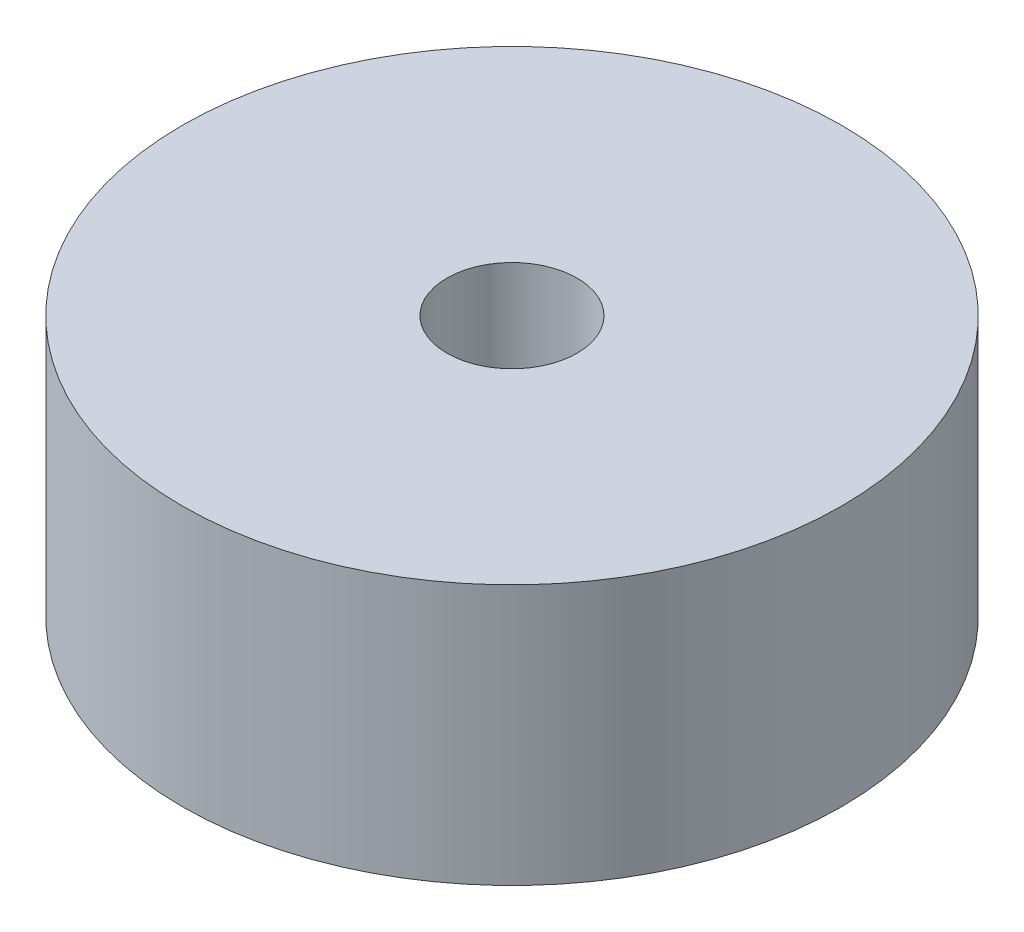
ISO-10303-21;
HEADER;
FILE_DESCRIPTION(('STEP AP214'),'2;1');
FILE_NAME('part.step','',(''),(''),'','','');
FILE_SCHEMA(('AUTOMOTIVE_DESIGN { 1 0 10303 214 1 1 1 1 }'));
ENDSEC;
DATA;
#1=APPLICATION_CONTEXT('core data for automotive mechanical design processes');
#2=APPLICATION_PROTOCOL_DEFINITION('international standard','automotive_design',2000,#1);
#3=PRODUCT_CONTEXT('',#1,'mechanical');
#4=PRODUCT('Part','Part','',(#3));
#5=PRODUCT_RELATED_PRODUCT_CATEGORY('part','',(#4));
#6=PRODUCT_DEFINITION_FORMATION('','',#4);
#7=PRODUCT_DEFINITION_CONTEXT('part definition',#1,'design');
#8=PRODUCT_DEFINITION('design','',#6,#7);
#9=PRODUCT_DEFINITION_SHAPE('','',#8);
#10=(LENGTH_UNIT() NAMED_UNIT(*) SI_UNIT(.MILLI.,.METRE.));
#11=(NAMED_UNIT(*) PLANE_ANGLE_UNIT() SI_UNIT($,.RADIAN.));
#12=(NAMED_UNIT(*) SI_UNIT($,.STERADIAN.) SOLID_ANGLE_UNIT());
#13=UNCERTAINTY_MEASURE_WITH_UNIT(LENGTH_MEASURE(1.E-05),#10,'distance_accuracy_value','');
#14=(GEOMETRIC_REPRESENTATION_CONTEXT(3) GLOBAL_UNCERTAINTY_ASSIGNED_CONTEXT((#13)) GLOBAL_UNIT_ASSIGNED_CONTEXT((#10,
#11,#12)) REPRESENTATION_CONTEXT('',''));
#15=CARTESIAN_POINT('',(0.,0.,0.));
#16=DIRECTION('',(0.,0.,1.));
#17=DIRECTION('',(1.,0.,0.));
#18=AXIS2_PLACEMENT_3D('',#15,#16,#17);
#19=CARTESIAN_POINT('',(0.,6.35,0.));
#20=DIRECTION('',(0.,1.,0.));
#21=DIRECTION('',(0.,0.,1.));
#22=AXIS2_PLACEMENT_3D('',#19,#20,#21);
#23=PLANE('',#22);
#24=CARTESIAN_POINT('',(0.,6.35,0.));
#25=DIRECTION('',(0.,1.,0.));
#26=DIRECTION('',(0.,0.,1.));
#27=AXIS2_PLACEMENT_3D('',#24,#25,#26);
#28=CIRCLE('',#27,8.0391);
#29=CARTESIAN_POINT('',(0.,6.35,8.0391));
#30=VERTEX_POINT('',#29);
#31=EDGE_CURVE('E11',#30,#30,#28,.T.);
#32=ORIENTED_EDGE('',*,*,#31,.T.);
#33=EDGE_LOOP('',(#32));
#34=FACE_BOUND('',#33,.T.);
#35=CARTESIAN_POINT('',(0.,6.35,0.));
#36=DIRECTION('',(0.,1.,0.));
#37=DIRECTION('',(0.,0.,1.));
#38=AXIS2_PLACEMENT_3D('',#35,#36,#37);
#39=CIRCLE('',#38,1.5875);
#40=CARTESIAN_POINT('',(0.,6.35,1.5875));
#41=VERTEX_POINT('',#40);
#42=EDGE_CURVE('E51',#41,#41,#39,.T.);
#43=ORIENTED_EDGE('',*,*,#42,.F.);
#44=EDGE_LOOP('',(#43));
#45=FACE_BOUND('',#44,.T.);
#46=ADVANCED_FACE('F38',(#34,#45),#23,.T.);
#47=CARTESIAN_POINT('',(0.,0.,0.));
#48=DIRECTION('',(0.,1.,0.));
#49=DIRECTION('',(0.,0.,1.));
#50=AXIS2_PLACEMENT_3D('',#47,#48,#49);
#51=PLANE('',#50);
#52=CARTESIAN_POINT('',(0.,0.,0.));
#53=DIRECTION('',(0.,1.,0.));
#54=DIRECTION('',(0.,0.,1.));
#55=AXIS2_PLACEMENT_3D('',#52,#53,#54);
#56=CIRCLE('',#55,8.0391);
#57=CARTESIAN_POINT('',(0.,0.,8.0391));
#58=VERTEX_POINT('',#57);
#59=EDGE_CURVE('E42',#58,#58,#56,.T.);
#60=ORIENTED_EDGE('',*,*,#59,.F.);
#61=EDGE_LOOP('',(#60));
#62=FACE_BOUND('',#61,.T.);
#63=CARTESIAN_POINT('',(0.,0.,0.));
#64=DIRECTION('',(0.,1.,0.));
#65=DIRECTION('',(0.,0.,1.));
#66=AXIS2_PLACEMENT_3D('',#63,#64,#65);
#67=CIRCLE('',#66,1.5875);
#68=CARTESIAN_POINT('',(0.,0.,1.5875));
#69=VERTEX_POINT('',#68);
#70=EDGE_CURVE('E54',#69,#69,#67,.T.);
#71=ORIENTED_EDGE('',*,*,#70,.T.);
#72=EDGE_LOOP('',(#71));
#73=FACE_BOUND('',#72,.T.);
#74=ADVANCED_FACE('F66',(#62,#73),#51,.F.);
#75=CARTESIAN_POINT('',(0.,6.35,0.));
#76=DIRECTION('',(0.,-1.,0.));
#77=DIRECTION('',(0.,0.,-1.));
#78=AXIS2_PLACEMENT_3D('',#75,#76,#77);
#79=CYLINDRICAL_SURFACE('',#78,8.0391);
#80=ORIENTED_EDGE('',*,*,#31,.F.);
#81=EDGE_LOOP('',(#80));
#82=FACE_BOUND('',#81,.T.);
#83=ORIENTED_EDGE('',*,*,#59,.T.);
#84=EDGE_LOOP('',(#83));
#85=FACE_BOUND('',#84,.T.);
#86=ADVANCED_FACE('F40',(#82,#85),#79,.T.);
#87=CARTESIAN_POINT('',(0.,6.35,0.));
#88=DIRECTION('',(0.,-1.,0.));
#89=DIRECTION('',(0.,0.,-1.));
#90=AXIS2_PLACEMENT_3D('',#87,#88,#89);
#91=CYLINDRICAL_SURFACE('',#90,1.5875);
#92=ORIENTED_EDGE('',*,*,#42,.T.);
#93=EDGE_LOOP('',(#92));
#94=FACE_BOUND('',#93,.T.);
#95=ORIENTED_EDGE('',*,*,#70,.F.);
#96=EDGE_LOOP('',(#95));
#97=FACE_BOUND('',#96,.T.);
#98=ADVANCED_FACE('F62',(#94,#97),#91,.F.);
#99=CLOSED_SHELL('',(#46,#74,#86,#98));
#100=MANIFOLD_SOLID_BREP('B2',#99);
#101=ADVANCED_BREP_SHAPE_REPRESENTATION('',(#18,#100),#14);
#102=SHAPE_DEFINITION_REPRESENTATION(#9,#101);
ENDSEC;
END-ISO-10303-21;
